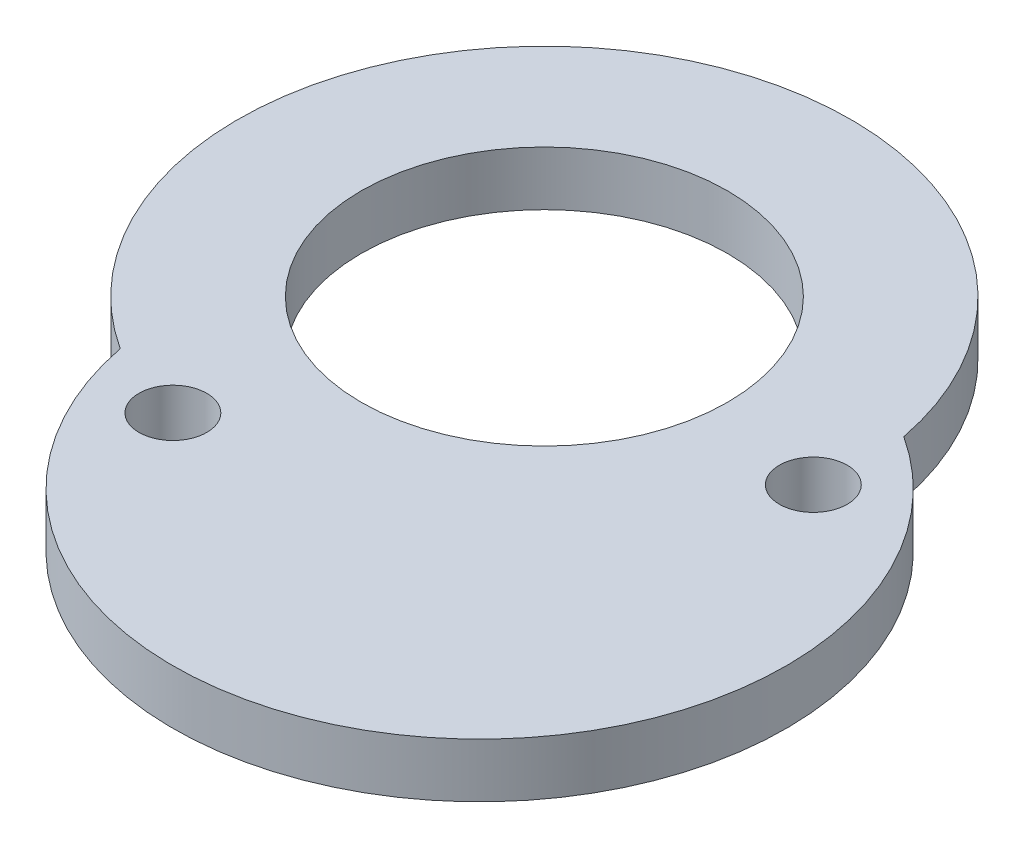
ISO-10303-21;
HEADER;
FILE_DESCRIPTION(('STEP AP214'),'2;1');
FILE_NAME('part.step','',(''),(''),'','','');
FILE_SCHEMA(('AUTOMOTIVE_DESIGN { 1 0 10303 214 1 1 1 1 }'));
ENDSEC;
DATA;
#1=APPLICATION_CONTEXT('core data for automotive mechanical design processes');
#2=APPLICATION_PROTOCOL_DEFINITION('international standard','automotive_design',2000,#1);
#3=PRODUCT_CONTEXT('',#1,'mechanical');
#4=PRODUCT('Part','Part','',(#3));
#5=PRODUCT_RELATED_PRODUCT_CATEGORY('part','',(#4));
#6=PRODUCT_DEFINITION_FORMATION('','',#4);
#7=PRODUCT_DEFINITION_CONTEXT('part definition',#1,'design');
#8=PRODUCT_DEFINITION('design','',#6,#7);
#9=PRODUCT_DEFINITION_SHAPE('','',#8);
#10=(LENGTH_UNIT() NAMED_UNIT(*) SI_UNIT(.MILLI.,.METRE.));
#11=(NAMED_UNIT(*) PLANE_ANGLE_UNIT() SI_UNIT($,.RADIAN.));
#12=(NAMED_UNIT(*) SI_UNIT($,.STERADIAN.) SOLID_ANGLE_UNIT());
#13=UNCERTAINTY_MEASURE_WITH_UNIT(LENGTH_MEASURE(1.E-05),#10,'distance_accuracy_value','');
#14=(GEOMETRIC_REPRESENTATION_CONTEXT(3) GLOBAL_UNCERTAINTY_ASSIGNED_CONTEXT((#13)) GLOBAL_UNIT_ASSIGNED_CONTEXT((#10,
#11,#12)) REPRESENTATION_CONTEXT('',''));
#15=CARTESIAN_POINT('',(0.,0.,0.));
#16=DIRECTION('',(0.,0.,1.));
#17=DIRECTION('',(1.,0.,0.));
#18=AXIS2_PLACEMENT_3D('',#15,#16,#17);
#19=CARTESIAN_POINT('',(2.47122775463809,2.,3.66374581333182));
#20=DIRECTION('',(0.,1.,0.));
#21=DIRECTION('',(0.,0.,1.));
#22=AXIS2_PLACEMENT_3D('',#19,#20,#21);
#23=PLANE('',#22);
#24=CARTESIAN_POINT('',(-3.13246904242263,2.,10.5564026873866));
#25=DIRECTION('',(0.,1.,0.));
#26=DIRECTION('',(0.,0.,1.));
#27=AXIS2_PLACEMENT_3D('',#24,#25,#26);
#28=CIRCLE('',#27,1.25);
#29=CARTESIAN_POINT('',(-3.13246904242263,2.,11.8064026873866));
#30=VERTEX_POINT('',#29);
#31=EDGE_CURVE('E81',#30,#30,#28,.T.);
#32=ORIENTED_EDGE('',*,*,#31,.F.);
#33=EDGE_LOOP('',(#32));
#34=FACE_BOUND('',#33,.T.);
#35=CARTESIAN_POINT('',(4.94245550927618,2.,7.32749162666364));
#36=DIRECTION('',(0.,1.,0.));
#37=DIRECTION('',(0.,0.,1.));
#38=AXIS2_PLACEMENT_3D('',#35,#36,#37);
#39=CIRCLE('',#38,11.3);
#40=CARTESIAN_POINT('',(-6.15076299993436,2.,9.47935200942758));
#41=VERTEX_POINT('',#40);
#42=CARTESIAN_POINT('',(11.0932185092105,2.,-2.15186038276391));
#43=VERTEX_POINT('',#42);
#44=EDGE_CURVE('E66',#41,#43,#39,.T.);
#45=ORIENTED_EDGE('',*,*,#44,.T.);
#46=CARTESIAN_POINT('',(0.,2.,0.));
#47=DIRECTION('',(0.,1.,0.));
#48=DIRECTION('',(0.,0.,1.));
#49=AXIS2_PLACEMENT_3D('',#46,#47,#48);
#50=CIRCLE('',#49,11.3);
#51=EDGE_CURVE('E51',#43,#41,#50,.T.);
#52=ORIENTED_EDGE('',*,*,#51,.T.);
#53=EDGE_LOOP('',(#45,#52));
#54=FACE_BOUND('',#53,.T.);
#55=CARTESIAN_POINT('',(0.,2.,0.));
#56=DIRECTION('',(0.,1.,0.));
#57=DIRECTION('',(0.,0.,1.));
#58=AXIS2_PLACEMENT_3D('',#55,#56,#57);
#59=CIRCLE('',#58,6.75000000000002);
#60=CARTESIAN_POINT('',(0.,2.,6.75000000000002));
#61=VERTEX_POINT('',#60);
#62=EDGE_CURVE('E72',#61,#61,#59,.T.);
#63=ORIENTED_EDGE('',*,*,#62,.F.);
#64=EDGE_LOOP('',(#63));
#65=FACE_BOUND('',#64,.T.);
#66=CARTESIAN_POINT('',(10.9611696910131,2.,1.05012332838399));
#67=DIRECTION('',(0.,1.,0.));
#68=DIRECTION('',(0.,0.,1.));
#69=AXIS2_PLACEMENT_3D('',#66,#67,#68);
#70=CIRCLE('',#69,1.25);
#71=CARTESIAN_POINT('',(10.9611696910131,2.,2.30012332838399));
#72=VERTEX_POINT('',#71);
#73=EDGE_CURVE('E86',#72,#72,#70,.T.);
#74=ORIENTED_EDGE('',*,*,#73,.F.);
#75=EDGE_LOOP('',(#74));
#76=FACE_BOUND('',#75,.T.);
#77=ADVANCED_FACE('F35',(#34,#54,#65,#76),#23,.T.);
#78=CARTESIAN_POINT('',(2.47122775463809,0.,3.66374581333182));
#79=DIRECTION('',(0.,1.,0.));
#80=DIRECTION('',(0.,0.,1.));
#81=AXIS2_PLACEMENT_3D('',#78,#79,#80);
#82=PLANE('',#81);
#83=CARTESIAN_POINT('',(-3.13246904242263,0.,10.5564026873866));
#84=DIRECTION('',(0.,1.,0.));
#85=DIRECTION('',(0.,0.,1.));
#86=AXIS2_PLACEMENT_3D('',#83,#84,#85);
#87=CIRCLE('',#86,1.25);
#88=CARTESIAN_POINT('',(-3.13246904242263,0.,11.8064026873866));
#89=VERTEX_POINT('',#88);
#90=EDGE_CURVE('E83',#89,#89,#87,.T.);
#91=ORIENTED_EDGE('',*,*,#90,.T.);
#92=EDGE_LOOP('',(#91));
#93=FACE_BOUND('',#92,.T.);
#94=CARTESIAN_POINT('',(4.94245550927618,0.,7.32749162666364));
#95=DIRECTION('',(0.,1.,0.));
#96=DIRECTION('',(0.,0.,1.));
#97=AXIS2_PLACEMENT_3D('',#94,#95,#96);
#98=CIRCLE('',#97,11.3);
#99=CARTESIAN_POINT('',(-6.15076299993436,0.,9.47935200942758));
#100=VERTEX_POINT('',#99);
#101=CARTESIAN_POINT('',(11.0932185092105,0.,-2.15186038276391));
#102=VERTEX_POINT('',#101);
#103=EDGE_CURVE('E67',#100,#102,#98,.T.);
#104=ORIENTED_EDGE('',*,*,#103,.F.);
#105=CARTESIAN_POINT('',(0.,0.,0.));
#106=DIRECTION('',(0.,1.,0.));
#107=DIRECTION('',(0.,0.,1.));
#108=AXIS2_PLACEMENT_3D('',#105,#106,#107);
#109=CIRCLE('',#108,11.3);
#110=EDGE_CURVE('E59',#102,#100,#109,.T.);
#111=ORIENTED_EDGE('',*,*,#110,.F.);
#112=EDGE_LOOP('',(#104,#111));
#113=FACE_BOUND('',#112,.T.);
#114=CARTESIAN_POINT('',(0.,0.,0.));
#115=DIRECTION('',(0.,1.,0.));
#116=DIRECTION('',(0.,0.,1.));
#117=AXIS2_PLACEMENT_3D('',#114,#115,#116);
#118=CIRCLE('',#117,6.75000000000002);
#119=CARTESIAN_POINT('',(0.,0.,6.75000000000002));
#120=VERTEX_POINT('',#119);
#121=EDGE_CURVE('E75',#120,#120,#118,.T.);
#122=ORIENTED_EDGE('',*,*,#121,.T.);
#123=EDGE_LOOP('',(#122));
#124=FACE_BOUND('',#123,.T.);
#125=CARTESIAN_POINT('',(10.9611696910131,0.,1.05012332838399));
#126=DIRECTION('',(0.,1.,0.));
#127=DIRECTION('',(0.,0.,1.));
#128=AXIS2_PLACEMENT_3D('',#125,#126,#127);
#129=CIRCLE('',#128,1.25);
#130=CARTESIAN_POINT('',(10.9611696910131,0.,2.30012332838399));
#131=VERTEX_POINT('',#130);
#132=EDGE_CURVE('E89',#131,#131,#129,.T.);
#133=ORIENTED_EDGE('',*,*,#132,.T.);
#134=EDGE_LOOP('',(#133));
#135=FACE_BOUND('',#134,.T.);
#136=ADVANCED_FACE('F70',(#93,#113,#124,#135),#82,.F.);
#137=CARTESIAN_POINT('',(4.94245550927618,2.,7.32749162666364));
#138=DIRECTION('',(0.,-1.,0.));
#139=DIRECTION('',(0.,0.,-1.));
#140=AXIS2_PLACEMENT_3D('',#137,#138,#139);
#141=CYLINDRICAL_SURFACE('',#140,11.3);
#142=ORIENTED_EDGE('',*,*,#103,.T.);
#143=DIRECTION('',(0.,-1.,0.));
#144=VECTOR('',#143,1.);
#145=CARTESIAN_POINT('',(11.0932185092105,2.,-2.15186038276391));
#146=LINE('',#145,#144);
#147=EDGE_CURVE('E11',#43,#102,#146,.T.);
#148=ORIENTED_EDGE('',*,*,#147,.F.);
#149=ORIENTED_EDGE('',*,*,#44,.F.);
#150=DIRECTION('',(0.,-1.,0.));
#151=VECTOR('',#150,1.);
#152=CARTESIAN_POINT('',(-6.15076299993436,2.,9.47935200942758));
#153=LINE('',#152,#151);
#154=EDGE_CURVE('E44',#41,#100,#153,.T.);
#155=ORIENTED_EDGE('',*,*,#154,.T.);
#156=EDGE_LOOP('',(#142,#148,#149,#155));
#157=FACE_BOUND('',#156,.T.);
#158=ADVANCED_FACE('F37',(#157),#141,.T.);
#159=CARTESIAN_POINT('',(0.,2.,0.));
#160=DIRECTION('',(0.,-1.,0.));
#161=DIRECTION('',(0.,0.,-1.));
#162=AXIS2_PLACEMENT_3D('',#159,#160,#161);
#163=CYLINDRICAL_SURFACE('',#162,11.3);
#164=ORIENTED_EDGE('',*,*,#110,.T.);
#165=ORIENTED_EDGE('',*,*,#154,.F.);
#166=ORIENTED_EDGE('',*,*,#51,.F.);
#167=ORIENTED_EDGE('',*,*,#147,.T.);
#168=EDGE_LOOP('',(#164,#165,#166,#167));
#169=FACE_BOUND('',#168,.T.);
#170=ADVANCED_FACE('F62',(#169),#163,.T.);
#171=CARTESIAN_POINT('',(0.,2.,0.));
#172=DIRECTION('',(0.,-1.,0.));
#173=DIRECTION('',(0.,0.,-1.));
#174=AXIS2_PLACEMENT_3D('',#171,#172,#173);
#175=CYLINDRICAL_SURFACE('',#174,6.75000000000002);
#176=ORIENTED_EDGE('',*,*,#62,.T.);
#177=EDGE_LOOP('',(#176));
#178=FACE_BOUND('',#177,.T.);
#179=ORIENTED_EDGE('',*,*,#121,.F.);
#180=EDGE_LOOP('',(#179));
#181=FACE_BOUND('',#180,.T.);
#182=ADVANCED_FACE('F108',(#178,#181),#175,.F.);
#183=CARTESIAN_POINT('',(-3.13246904242263,2.,10.5564026873866));
#184=DIRECTION('',(0.,-1.,0.));
#185=DIRECTION('',(0.,0.,-1.));
#186=AXIS2_PLACEMENT_3D('',#183,#184,#185);
#187=CYLINDRICAL_SURFACE('',#186,1.25);
#188=ORIENTED_EDGE('',*,*,#31,.T.);
#189=EDGE_LOOP('',(#188));
#190=FACE_BOUND('',#189,.T.);
#191=ORIENTED_EDGE('',*,*,#90,.F.);
#192=EDGE_LOOP('',(#191));
#193=FACE_BOUND('',#192,.T.);
#194=ADVANCED_FACE('F115',(#190,#193),#187,.F.);
#195=CARTESIAN_POINT('',(10.9611696910131,2.,1.05012332838399));
#196=DIRECTION('',(0.,-1.,0.));
#197=DIRECTION('',(0.,0.,-1.));
#198=AXIS2_PLACEMENT_3D('',#195,#196,#197);
#199=CYLINDRICAL_SURFACE('',#198,1.25);
#200=ORIENTED_EDGE('',*,*,#73,.T.);
#201=EDGE_LOOP('',(#200));
#202=FACE_BOUND('',#201,.T.);
#203=ORIENTED_EDGE('',*,*,#132,.F.);
#204=EDGE_LOOP('',(#203));
#205=FACE_BOUND('',#204,.T.);
#206=ADVANCED_FACE('F95',(#202,#205),#199,.F.);
#207=CLOSED_SHELL('',(#77,#136,#158,#170,#182,#194,#206));
#208=MANIFOLD_SOLID_BREP('B2',#207);
#209=ADVANCED_BREP_SHAPE_REPRESENTATION('',(#18,#208),#14);
#210=SHAPE_DEFINITION_REPRESENTATION(#9,#209);
ENDSEC;
END-ISO-10303-21;
